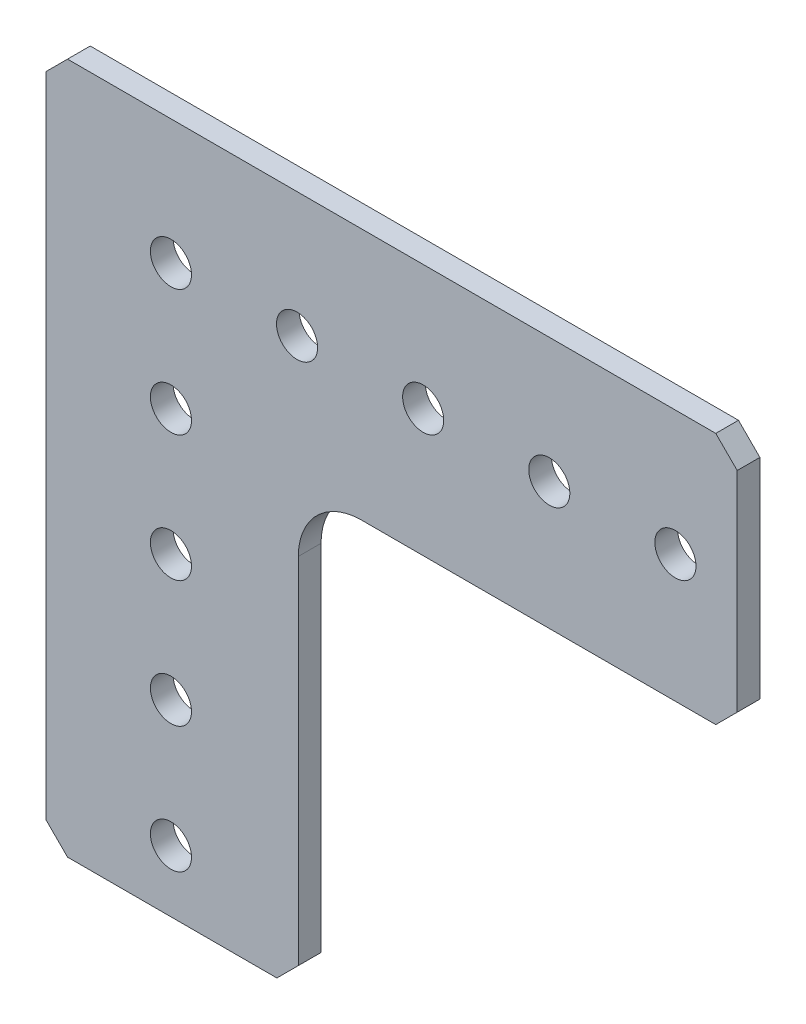
ISO-10303-21;
HEADER;
FILE_DESCRIPTION(('STEP AP214'),'2;1');
FILE_NAME('part.step','',(''),(''),'','','');
FILE_SCHEMA(('AUTOMOTIVE_DESIGN { 1 0 10303 214 1 1 1 1 }'));
ENDSEC;
DATA;
#1=APPLICATION_CONTEXT('core data for automotive mechanical design processes');
#2=APPLICATION_PROTOCOL_DEFINITION('international standard','automotive_design',2000,#1);
#3=PRODUCT_CONTEXT('',#1,'mechanical');
#4=PRODUCT('Part','Part','',(#3));
#5=PRODUCT_RELATED_PRODUCT_CATEGORY('part','',(#4));
#6=PRODUCT_DEFINITION_FORMATION('','',#4);
#7=PRODUCT_DEFINITION_CONTEXT('part definition',#1,'design');
#8=PRODUCT_DEFINITION('design','',#6,#7);
#9=PRODUCT_DEFINITION_SHAPE('','',#8);
#10=(LENGTH_UNIT() NAMED_UNIT(*) SI_UNIT(.MILLI.,.METRE.));
#11=(NAMED_UNIT(*) PLANE_ANGLE_UNIT() SI_UNIT($,.RADIAN.));
#12=(NAMED_UNIT(*) SI_UNIT($,.STERADIAN.) SOLID_ANGLE_UNIT());
#13=UNCERTAINTY_MEASURE_WITH_UNIT(LENGTH_MEASURE(1.E-05),#10,'distance_accuracy_value','');
#14=(GEOMETRIC_REPRESENTATION_CONTEXT(3) GLOBAL_UNCERTAINTY_ASSIGNED_CONTEXT((#13)) GLOBAL_UNIT_ASSIGNED_CONTEXT((#10,
#11,#12)) REPRESENTATION_CONTEXT('',''));
#15=CARTESIAN_POINT('',(0.,0.,0.));
#16=DIRECTION('',(0.,0.,1.));
#17=DIRECTION('',(1.,0.,0.));
#18=AXIS2_PLACEMENT_3D('',#15,#16,#17);
#19=CARTESIAN_POINT('',(-12.573,10.414,2.286));
#20=DIRECTION('',(-0.707106781186548,0.707106781186547,0.));
#21=DIRECTION('',(-0.707106781186547,-0.707106781186548,0.));
#22=AXIS2_PLACEMENT_3D('',#19,#20,#21);
#23=PLANE('',#22);
#24=DIRECTION('',(0.707106781186547,0.707106781186548,0.));
#25=VECTOR('',#24,1.);
#26=CARTESIAN_POINT('',(-12.573,10.414,0.));
#27=LINE('',#26,#25);
#28=CARTESIAN_POINT('',(-12.573,10.414,0.));
#29=VERTEX_POINT('',#28);
#30=CARTESIAN_POINT('',(-10.414,12.573,0.));
#31=VERTEX_POINT('',#30);
#32=EDGE_CURVE('E156',#29,#31,#27,.T.);
#33=ORIENTED_EDGE('',*,*,#32,.F.);
#34=DIRECTION('',(0.,0.,-1.));
#35=VECTOR('',#34,1.);
#36=CARTESIAN_POINT('',(-12.573,10.414,2.286));
#37=LINE('',#36,#35);
#38=CARTESIAN_POINT('',(-12.573,10.414,2.286));
#39=VERTEX_POINT('',#38);
#40=EDGE_CURVE('E11',#39,#29,#37,.T.);
#41=ORIENTED_EDGE('',*,*,#40,.F.);
#42=DIRECTION('',(0.707106781186547,0.707106781186548,0.));
#43=VECTOR('',#42,1.);
#44=CARTESIAN_POINT('',(-12.573,10.414,2.286));
#45=LINE('',#44,#43);
#46=CARTESIAN_POINT('',(-10.414,12.573,2.286));
#47=VERTEX_POINT('',#46);
#48=EDGE_CURVE('E189',#39,#47,#45,.T.);
#49=ORIENTED_EDGE('',*,*,#48,.T.);
#50=DIRECTION('',(0.,0.,-1.));
#51=VECTOR('',#50,1.);
#52=CARTESIAN_POINT('',(-10.414,12.573,2.286));
#53=LINE('',#52,#51);
#54=EDGE_CURVE('E38',#47,#31,#53,.T.);
#55=ORIENTED_EDGE('',*,*,#54,.T.);
#56=EDGE_LOOP('',(#33,#41,#49,#55));
#57=FACE_BOUND('',#56,.T.);
#58=ADVANCED_FACE('F35',(#57),#23,.T.);
#59=CARTESIAN_POINT('',(-12.573,-54.864,2.286));
#60=DIRECTION('',(-1.,0.,0.));
#61=DIRECTION('',(0.,-1.,0.));
#62=AXIS2_PLACEMENT_3D('',#59,#60,#61);
#63=PLANE('',#62);
#64=DIRECTION('',(0.,1.,0.));
#65=VECTOR('',#64,1.);
#66=CARTESIAN_POINT('',(-12.573,-54.864,0.));
#67=LINE('',#66,#65);
#68=CARTESIAN_POINT('',(-12.573,-54.864,0.));
#69=VERTEX_POINT('',#68);
#70=EDGE_CURVE('E187',#69,#29,#67,.T.);
#71=ORIENTED_EDGE('',*,*,#70,.F.);
#72=DIRECTION('',(0.,0.,-1.));
#73=VECTOR('',#72,1.);
#74=CARTESIAN_POINT('',(-12.573,-54.864,2.286));
#75=LINE('',#74,#73);
#76=CARTESIAN_POINT('',(-12.573,-54.864,2.286));
#77=VERTEX_POINT('',#76);
#78=EDGE_CURVE('E44',#77,#69,#75,.T.);
#79=ORIENTED_EDGE('',*,*,#78,.F.);
#80=DIRECTION('',(0.,1.,0.));
#81=VECTOR('',#80,1.);
#82=CARTESIAN_POINT('',(-12.573,-54.864,2.286));
#83=LINE('',#82,#81);
#84=EDGE_CURVE('E146',#77,#39,#83,.T.);
#85=ORIENTED_EDGE('',*,*,#84,.T.);
#86=ORIENTED_EDGE('',*,*,#40,.T.);
#87=EDGE_LOOP('',(#71,#79,#85,#86));
#88=FACE_BOUND('',#87,.T.);
#89=ADVANCED_FACE('F209',(#88),#63,.T.);
#90=CARTESIAN_POINT('',(-10.414,-57.023,2.286));
#91=DIRECTION('',(-0.707106781186544,-0.707106781186551,0.));
#92=DIRECTION('',(0.707106781186551,-0.707106781186544,0.));
#93=AXIS2_PLACEMENT_3D('',#90,#91,#92);
#94=PLANE('',#93);
#95=DIRECTION('',(-0.707106781186551,0.707106781186544,0.));
#96=VECTOR('',#95,1.);
#97=CARTESIAN_POINT('',(-10.414,-57.023,0.));
#98=LINE('',#97,#96);
#99=CARTESIAN_POINT('',(-10.414,-57.023,0.));
#100=VERTEX_POINT('',#99);
#101=EDGE_CURVE('E133',#100,#69,#98,.T.);
#102=ORIENTED_EDGE('',*,*,#101,.F.);
#103=DIRECTION('',(0.,0.,-1.));
#104=VECTOR('',#103,1.);
#105=CARTESIAN_POINT('',(-10.414,-57.023,2.286));
#106=LINE('',#105,#104);
#107=CARTESIAN_POINT('',(-10.414,-57.023,2.286));
#108=VERTEX_POINT('',#107);
#109=EDGE_CURVE('E128',#108,#100,#106,.T.);
#110=ORIENTED_EDGE('',*,*,#109,.F.);
#111=DIRECTION('',(-0.707106781186551,0.707106781186544,0.));
#112=VECTOR('',#111,1.);
#113=CARTESIAN_POINT('',(-10.414,-57.023,2.286));
#114=LINE('',#113,#112);
#115=EDGE_CURVE('E131',#108,#77,#114,.T.);
#116=ORIENTED_EDGE('',*,*,#115,.T.);
#117=ORIENTED_EDGE('',*,*,#78,.T.);
#118=EDGE_LOOP('',(#102,#110,#116,#117));
#119=FACE_BOUND('',#118,.T.);
#120=ADVANCED_FACE('F130',(#119),#94,.T.);
#121=CARTESIAN_POINT('',(10.668,-57.023,2.286));
#122=DIRECTION('',(0.,-1.,0.));
#123=DIRECTION('',(1.,0.,0.));
#124=AXIS2_PLACEMENT_3D('',#121,#122,#123);
#125=PLANE('',#124);
#126=DIRECTION('',(-1.,0.,0.));
#127=VECTOR('',#126,1.);
#128=CARTESIAN_POINT('',(10.668,-57.023,0.));
#129=LINE('',#128,#127);
#130=CARTESIAN_POINT('',(10.668,-57.023,0.));
#131=VERTEX_POINT('',#130);
#132=EDGE_CURVE('E184',#131,#100,#129,.T.);
#133=ORIENTED_EDGE('',*,*,#132,.F.);
#134=DIRECTION('',(0.,0.,-1.));
#135=VECTOR('',#134,1.);
#136=CARTESIAN_POINT('',(10.668,-57.023,2.286));
#137=LINE('',#136,#135);
#138=CARTESIAN_POINT('',(10.668,-57.023,2.286));
#139=VERTEX_POINT('',#138);
#140=EDGE_CURVE('E138',#139,#131,#137,.T.);
#141=ORIENTED_EDGE('',*,*,#140,.F.);
#142=DIRECTION('',(-1.,0.,0.));
#143=VECTOR('',#142,1.);
#144=CARTESIAN_POINT('',(10.668,-57.023,2.286));
#145=LINE('',#144,#143);
#146=EDGE_CURVE('E144',#139,#108,#145,.T.);
#147=ORIENTED_EDGE('',*,*,#146,.T.);
#148=ORIENTED_EDGE('',*,*,#109,.T.);
#149=EDGE_LOOP('',(#133,#141,#147,#148));
#150=FACE_BOUND('',#149,.T.);
#151=ADVANCED_FACE('F148',(#150),#125,.T.);
#152=CARTESIAN_POINT('',(12.827,-54.864,2.286));
#153=DIRECTION('',(0.707106781186548,-0.707106781186547,0.));
#154=DIRECTION('',(0.707106781186547,0.707106781186548,0.));
#155=AXIS2_PLACEMENT_3D('',#152,#153,#154);
#156=PLANE('',#155);
#157=DIRECTION('',(-0.707106781186547,-0.707106781186548,0.));
#158=VECTOR('',#157,1.);
#159=CARTESIAN_POINT('',(12.827,-54.864,0.));
#160=LINE('',#159,#158);
#161=CARTESIAN_POINT('',(12.827,-54.864,0.));
#162=VERTEX_POINT('',#161);
#163=EDGE_CURVE('E181',#162,#131,#160,.T.);
#164=ORIENTED_EDGE('',*,*,#163,.F.);
#165=DIRECTION('',(0.,0.,-1.));
#166=VECTOR('',#165,1.);
#167=CARTESIAN_POINT('',(12.827,-54.864,2.286));
#168=LINE('',#167,#166);
#169=CARTESIAN_POINT('',(12.827,-54.864,2.286));
#170=VERTEX_POINT('',#169);
#171=EDGE_CURVE('E193',#170,#162,#168,.T.);
#172=ORIENTED_EDGE('',*,*,#171,.F.);
#173=DIRECTION('',(-0.707106781186547,-0.707106781186548,0.));
#174=VECTOR('',#173,1.);
#175=CARTESIAN_POINT('',(12.827,-54.864,2.286));
#176=LINE('',#175,#174);
#177=EDGE_CURVE('E149',#170,#139,#176,.T.);
#178=ORIENTED_EDGE('',*,*,#177,.T.);
#179=ORIENTED_EDGE('',*,*,#140,.T.);
#180=EDGE_LOOP('',(#164,#172,#178,#179));
#181=FACE_BOUND('',#180,.T.);
#182=ADVANCED_FACE('F222',(#181),#156,.T.);
#183=CARTESIAN_POINT('',(12.827,-19.177,2.286));
#184=DIRECTION('',(1.,0.,0.));
#185=DIRECTION('',(0.,0.,-1.));
#186=AXIS2_PLACEMENT_3D('',#183,#184,#185);
#187=PLANE('',#186);
#188=DIRECTION('',(0.,-1.,0.));
#189=VECTOR('',#188,1.);
#190=CARTESIAN_POINT('',(12.827,-19.177,0.));
#191=LINE('',#190,#189);
#192=CARTESIAN_POINT('',(12.827,-19.177,0.));
#193=VERTEX_POINT('',#192);
#194=EDGE_CURVE('E178',#193,#162,#191,.T.);
#195=ORIENTED_EDGE('',*,*,#194,.F.);
#196=DIRECTION('',(0.,0.,-1.));
#197=VECTOR('',#196,1.);
#198=CARTESIAN_POINT('',(12.827,-19.177,2.286));
#199=LINE('',#198,#197);
#200=CARTESIAN_POINT('',(12.827,-19.177,2.286));
#201=VERTEX_POINT('',#200);
#202=EDGE_CURVE('E195',#201,#193,#199,.T.);
#203=ORIENTED_EDGE('',*,*,#202,.F.);
#204=DIRECTION('',(0.,-1.,0.));
#205=VECTOR('',#204,1.);
#206=CARTESIAN_POINT('',(12.827,-19.177,2.286));
#207=LINE('',#206,#205);
#208=EDGE_CURVE('E151',#201,#170,#207,.T.);
#209=ORIENTED_EDGE('',*,*,#208,.T.);
#210=ORIENTED_EDGE('',*,*,#171,.T.);
#211=EDGE_LOOP('',(#195,#203,#209,#210));
#212=FACE_BOUND('',#211,.T.);
#213=ADVANCED_FACE('F225',(#212),#187,.T.);
#214=CARTESIAN_POINT('',(19.177,-19.177,2.286));
#215=DIRECTION('',(0.,0.,-1.));
#216=DIRECTION('',(-1.,0.,0.));
#217=AXIS2_PLACEMENT_3D('',#214,#215,#216);
#218=CYLINDRICAL_SURFACE('',#217,6.35);
#219=CARTESIAN_POINT('',(19.177,-19.177,0.));
#220=DIRECTION('',(0.,0.,1.));
#221=DIRECTION('',(1.,0.,0.));
#222=AXIS2_PLACEMENT_3D('',#219,#220,#221);
#223=CIRCLE('',#222,6.35);
#224=CARTESIAN_POINT('',(19.177,-12.827,0.));
#225=VERTEX_POINT('',#224);
#226=EDGE_CURVE('E175',#225,#193,#223,.T.);
#227=ORIENTED_EDGE('',*,*,#226,.F.);
#228=DIRECTION('',(0.,0.,-1.));
#229=VECTOR('',#228,1.);
#230=CARTESIAN_POINT('',(19.177,-12.827,2.286));
#231=LINE('',#230,#229);
#232=CARTESIAN_POINT('',(19.177,-12.827,2.286));
#233=VERTEX_POINT('',#232);
#234=EDGE_CURVE('E197',#233,#225,#231,.T.);
#235=ORIENTED_EDGE('',*,*,#234,.F.);
#236=CARTESIAN_POINT('',(19.177,-19.177,2.286));
#237=DIRECTION('',(0.,0.,1.));
#238=DIRECTION('',(1.,0.,0.));
#239=AXIS2_PLACEMENT_3D('',#236,#237,#238);
#240=CIRCLE('',#239,6.35);
#241=EDGE_CURVE('E369',#233,#201,#240,.T.);
#242=ORIENTED_EDGE('',*,*,#241,.T.);
#243=ORIENTED_EDGE('',*,*,#202,.T.);
#244=EDGE_LOOP('',(#227,#235,#242,#243));
#245=FACE_BOUND('',#244,.T.);
#246=ADVANCED_FACE('F229',(#245),#218,.F.);
#247=CARTESIAN_POINT('',(54.864,-12.827,2.286));
#248=DIRECTION('',(0.,-1.,0.));
#249=DIRECTION('',(0.,0.,-1.));
#250=AXIS2_PLACEMENT_3D('',#247,#248,#249);
#251=PLANE('',#250);
#252=DIRECTION('',(-1.,0.,0.));
#253=VECTOR('',#252,1.);
#254=CARTESIAN_POINT('',(54.864,-12.827,0.));
#255=LINE('',#254,#253);
#256=CARTESIAN_POINT('',(54.864,-12.827,0.));
#257=VERTEX_POINT('',#256);
#258=EDGE_CURVE('E172',#257,#225,#255,.T.);
#259=ORIENTED_EDGE('',*,*,#258,.F.);
#260=DIRECTION('',(0.,0.,-1.));
#261=VECTOR('',#260,1.);
#262=CARTESIAN_POINT('',(54.864,-12.827,2.286));
#263=LINE('',#262,#261);
#264=CARTESIAN_POINT('',(54.864,-12.827,2.286));
#265=VERTEX_POINT('',#264);
#266=EDGE_CURVE('E199',#265,#257,#263,.T.);
#267=ORIENTED_EDGE('',*,*,#266,.F.);
#268=DIRECTION('',(-1.,0.,0.));
#269=VECTOR('',#268,1.);
#270=CARTESIAN_POINT('',(54.864,-12.827,2.286));
#271=LINE('',#270,#269);
#272=EDGE_CURVE('E366',#265,#233,#271,.T.);
#273=ORIENTED_EDGE('',*,*,#272,.T.);
#274=ORIENTED_EDGE('',*,*,#234,.T.);
#275=EDGE_LOOP('',(#259,#267,#273,#274));
#276=FACE_BOUND('',#275,.T.);
#277=ADVANCED_FACE('F233',(#276),#251,.T.);
#278=CARTESIAN_POINT('',(57.023,-10.668,2.286));
#279=DIRECTION('',(0.707106781186548,-0.707106781186546,0.));
#280=DIRECTION('',(0.707106781186547,0.707106781186548,0.));
#281=AXIS2_PLACEMENT_3D('',#278,#279,#280);
#282=PLANE('',#281);
#283=DIRECTION('',(-0.707106781186547,-0.707106781186548,0.));
#284=VECTOR('',#283,1.);
#285=CARTESIAN_POINT('',(57.023,-10.668,0.));
#286=LINE('',#285,#284);
#287=CARTESIAN_POINT('',(57.023,-10.668,0.));
#288=VERTEX_POINT('',#287);
#289=EDGE_CURVE('E169',#288,#257,#286,.T.);
#290=ORIENTED_EDGE('',*,*,#289,.F.);
#291=DIRECTION('',(0.,0.,-1.));
#292=VECTOR('',#291,1.);
#293=CARTESIAN_POINT('',(57.023,-10.668,2.286));
#294=LINE('',#293,#292);
#295=CARTESIAN_POINT('',(57.023,-10.668,2.286));
#296=VERTEX_POINT('',#295);
#297=EDGE_CURVE('E201',#296,#288,#294,.T.);
#298=ORIENTED_EDGE('',*,*,#297,.F.);
#299=DIRECTION('',(-0.707106781186547,-0.707106781186548,0.));
#300=VECTOR('',#299,1.);
#301=CARTESIAN_POINT('',(57.023,-10.668,2.286));
#302=LINE('',#301,#300);
#303=EDGE_CURVE('E363',#296,#265,#302,.T.);
#304=ORIENTED_EDGE('',*,*,#303,.T.);
#305=ORIENTED_EDGE('',*,*,#266,.T.);
#306=EDGE_LOOP('',(#290,#298,#304,#305));
#307=FACE_BOUND('',#306,.T.);
#308=ADVANCED_FACE('F237',(#307),#282,.T.);
#309=CARTESIAN_POINT('',(57.023,10.414,2.286));
#310=DIRECTION('',(1.,0.,0.));
#311=DIRECTION('',(0.,1.,0.));
#312=AXIS2_PLACEMENT_3D('',#309,#310,#311);
#313=PLANE('',#312);
#314=DIRECTION('',(0.,-1.,0.));
#315=VECTOR('',#314,1.);
#316=CARTESIAN_POINT('',(57.023,10.414,0.));
#317=LINE('',#316,#315);
#318=CARTESIAN_POINT('',(57.023,10.414,0.));
#319=VERTEX_POINT('',#318);
#320=EDGE_CURVE('E166',#319,#288,#317,.T.);
#321=ORIENTED_EDGE('',*,*,#320,.F.);
#322=DIRECTION('',(0.,0.,-1.));
#323=VECTOR('',#322,1.);
#324=CARTESIAN_POINT('',(57.023,10.414,2.286));
#325=LINE('',#324,#323);
#326=CARTESIAN_POINT('',(57.023,10.414,2.286));
#327=VERTEX_POINT('',#326);
#328=EDGE_CURVE('E203',#327,#319,#325,.T.);
#329=ORIENTED_EDGE('',*,*,#328,.F.);
#330=DIRECTION('',(0.,-1.,0.));
#331=VECTOR('',#330,1.);
#332=CARTESIAN_POINT('',(57.023,10.414,2.286));
#333=LINE('',#332,#331);
#334=EDGE_CURVE('E360',#327,#296,#333,.T.);
#335=ORIENTED_EDGE('',*,*,#334,.T.);
#336=ORIENTED_EDGE('',*,*,#297,.T.);
#337=EDGE_LOOP('',(#321,#329,#335,#336));
#338=FACE_BOUND('',#337,.T.);
#339=ADVANCED_FACE('F241',(#338),#313,.T.);
#340=CARTESIAN_POINT('',(54.864,12.573,2.286));
#341=DIRECTION('',(0.707106781186544,0.70710678118655,0.));
#342=DIRECTION('',(-0.707106781186551,0.707106781186544,0.));
#343=AXIS2_PLACEMENT_3D('',#340,#341,#342);
#344=PLANE('',#343);
#345=DIRECTION('',(0.707106781186551,-0.707106781186544,0.));
#346=VECTOR('',#345,1.);
#347=CARTESIAN_POINT('',(54.864,12.573,0.));
#348=LINE('',#347,#346);
#349=CARTESIAN_POINT('',(54.864,12.573,0.));
#350=VERTEX_POINT('',#349);
#351=EDGE_CURVE('E163',#350,#319,#348,.T.);
#352=ORIENTED_EDGE('',*,*,#351,.F.);
#353=DIRECTION('',(0.,0.,-1.));
#354=VECTOR('',#353,1.);
#355=CARTESIAN_POINT('',(54.864,12.573,2.286));
#356=LINE('',#355,#354);
#357=CARTESIAN_POINT('',(54.864,12.573,2.286));
#358=VERTEX_POINT('',#357);
#359=EDGE_CURVE('E204',#358,#350,#356,.T.);
#360=ORIENTED_EDGE('',*,*,#359,.F.);
#361=DIRECTION('',(0.707106781186551,-0.707106781186544,0.));
#362=VECTOR('',#361,1.);
#363=CARTESIAN_POINT('',(54.864,12.573,2.286));
#364=LINE('',#363,#362);
#365=EDGE_CURVE('E357',#358,#327,#364,.T.);
#366=ORIENTED_EDGE('',*,*,#365,.T.);
#367=ORIENTED_EDGE('',*,*,#328,.T.);
#368=EDGE_LOOP('',(#352,#360,#366,#367));
#369=FACE_BOUND('',#368,.T.);
#370=ADVANCED_FACE('F245',(#369),#344,.T.);
#371=CARTESIAN_POINT('',(-10.414,12.573,2.286));
#372=DIRECTION('',(0.,1.,0.));
#373=DIRECTION('',(-1.,0.,0.));
#374=AXIS2_PLACEMENT_3D('',#371,#372,#373);
#375=PLANE('',#374);
#376=DIRECTION('',(1.,0.,0.));
#377=VECTOR('',#376,1.);
#378=CARTESIAN_POINT('',(-10.414,12.573,0.));
#379=LINE('',#378,#377);
#380=EDGE_CURVE('E159',#31,#350,#379,.T.);
#381=ORIENTED_EDGE('',*,*,#380,.F.);
#382=ORIENTED_EDGE('',*,*,#54,.F.);
#383=DIRECTION('',(1.,0.,0.));
#384=VECTOR('',#383,1.);
#385=CARTESIAN_POINT('',(-10.414,12.573,2.286));
#386=LINE('',#385,#384);
#387=EDGE_CURVE('E355',#47,#358,#386,.T.);
#388=ORIENTED_EDGE('',*,*,#387,.T.);
#389=ORIENTED_EDGE('',*,*,#359,.T.);
#390=EDGE_LOOP('',(#381,#382,#388,#389));
#391=FACE_BOUND('',#390,.T.);
#392=ADVANCED_FACE('F206',(#391),#375,.T.);
#393=CARTESIAN_POINT('',(19.177,-19.177,2.286));
#394=DIRECTION('',(0.,0.,1.));
#395=DIRECTION('',(1.,0.,0.));
#396=AXIS2_PLACEMENT_3D('',#393,#394,#395);
#397=PLANE('',#396);
#398=CARTESIAN_POINT('',(50.8,0.,2.286));
#399=DIRECTION('',(0.,0.,-1.));
#400=DIRECTION('',(1.,0.,0.));
#401=AXIS2_PLACEMENT_3D('',#398,#399,#400);
#402=CIRCLE('',#401,2.0701);
#403=CARTESIAN_POINT('',(52.8701,0.,2.286));
#404=VERTEX_POINT('',#403);
#405=EDGE_CURVE('E300',#404,#404,#402,.T.);
#406=ORIENTED_EDGE('',*,*,#405,.T.);
#407=EDGE_LOOP('',(#406));
#408=FACE_BOUND('',#407,.T.);
#409=CARTESIAN_POINT('',(3.9907631702977E-13,-38.1,2.286));
#410=DIRECTION('',(0.,0.,-1.));
#411=DIRECTION('',(1.,0.,0.));
#412=AXIS2_PLACEMENT_3D('',#409,#410,#411);
#413=CIRCLE('',#412,2.0701);
#414=CARTESIAN_POINT('',(2.0701000000004,-38.1,2.286));
#415=VERTEX_POINT('',#414);
#416=EDGE_CURVE('E308',#415,#415,#413,.T.);
#417=ORIENTED_EDGE('',*,*,#416,.T.);
#418=EDGE_LOOP('',(#417));
#419=FACE_BOUND('',#418,.T.);
#420=CARTESIAN_POINT('',(1.33025439009923E-13,-12.7,2.286));
#421=DIRECTION('',(0.,0.,-1.));
#422=DIRECTION('',(1.,0.,0.));
#423=AXIS2_PLACEMENT_3D('',#420,#421,#422);
#424=CIRCLE('',#423,2.0701);
#425=CARTESIAN_POINT('',(2.07010000000013,-12.7,2.286));
#426=VERTEX_POINT('',#425);
#427=EDGE_CURVE('E314',#426,#426,#424,.T.);
#428=ORIENTED_EDGE('',*,*,#427,.T.);
#429=EDGE_LOOP('',(#428));
#430=FACE_BOUND('',#429,.T.);
#431=CARTESIAN_POINT('',(25.4,3.54734504026462E-13,2.286));
#432=DIRECTION('',(0.,0.,-1.));
#433=DIRECTION('',(1.,0.,0.));
#434=AXIS2_PLACEMENT_3D('',#431,#432,#433);
#435=CIRCLE('',#434,2.0701);
#436=CARTESIAN_POINT('',(27.4701,3.54734504026462E-13,2.286));
#437=VERTEX_POINT('',#436);
#438=EDGE_CURVE('E320',#437,#437,#435,.T.);
#439=ORIENTED_EDGE('',*,*,#438,.T.);
#440=EDGE_LOOP('',(#439));
#441=FACE_BOUND('',#440,.T.);
#442=CARTESIAN_POINT('',(0.,0.,2.286));
#443=DIRECTION('',(0.,0.,-1.));
#444=DIRECTION('',(1.,0.,0.));
#445=AXIS2_PLACEMENT_3D('',#442,#443,#444);
#446=CIRCLE('',#445,2.0701);
#447=CARTESIAN_POINT('',(2.0701,0.,2.286));
#448=VERTEX_POINT('',#447);
#449=EDGE_CURVE('E326',#448,#448,#446,.T.);
#450=ORIENTED_EDGE('',*,*,#449,.T.);
#451=EDGE_LOOP('',(#450));
#452=FACE_BOUND('',#451,.T.);
#453=CARTESIAN_POINT('',(12.7,1.77367252013231E-13,2.286));
#454=DIRECTION('',(0.,0.,-1.));
#455=DIRECTION('',(1.,0.,0.));
#456=AXIS2_PLACEMENT_3D('',#453,#454,#455);
#457=CIRCLE('',#456,2.0701);
#458=CARTESIAN_POINT('',(14.7701,1.77367252013231E-13,2.286));
#459=VERTEX_POINT('',#458);
#460=EDGE_CURVE('E332',#459,#459,#457,.T.);
#461=ORIENTED_EDGE('',*,*,#460,.T.);
#462=EDGE_LOOP('',(#461));
#463=FACE_BOUND('',#462,.T.);
#464=CARTESIAN_POINT('',(38.1,0.,2.286));
#465=DIRECTION('',(0.,0.,-1.));
#466=DIRECTION('',(1.,0.,0.));
#467=AXIS2_PLACEMENT_3D('',#464,#465,#466);
#468=CIRCLE('',#467,2.0701);
#469=CARTESIAN_POINT('',(40.1701,0.,2.286));
#470=VERTEX_POINT('',#469);
#471=EDGE_CURVE('E338',#470,#470,#468,.T.);
#472=ORIENTED_EDGE('',*,*,#471,.T.);
#473=EDGE_LOOP('',(#472));
#474=FACE_BOUND('',#473,.T.);
#475=CARTESIAN_POINT('',(2.66050878019847E-13,-25.4,2.286));
#476=DIRECTION('',(0.,0.,-1.));
#477=DIRECTION('',(1.,0.,0.));
#478=AXIS2_PLACEMENT_3D('',#475,#476,#477);
#479=CIRCLE('',#478,2.0701);
#480=CARTESIAN_POINT('',(2.07010000000027,-25.4,2.286));
#481=VERTEX_POINT('',#480);
#482=EDGE_CURVE('E344',#481,#481,#479,.T.);
#483=ORIENTED_EDGE('',*,*,#482,.T.);
#484=EDGE_LOOP('',(#483));
#485=FACE_BOUND('',#484,.T.);
#486=CARTESIAN_POINT('',(0.,-50.8,2.286));
#487=DIRECTION('',(0.,0.,-1.));
#488=DIRECTION('',(1.,0.,0.));
#489=AXIS2_PLACEMENT_3D('',#486,#487,#488);
#490=CIRCLE('',#489,2.0701);
#491=CARTESIAN_POINT('',(2.07010000000001,-50.8,2.286));
#492=VERTEX_POINT('',#491);
#493=EDGE_CURVE('E160',#492,#492,#490,.T.);
#494=ORIENTED_EDGE('',*,*,#493,.T.);
#495=EDGE_LOOP('',(#494));
#496=FACE_BOUND('',#495,.T.);
#497=ORIENTED_EDGE('',*,*,#48,.F.);
#498=ORIENTED_EDGE('',*,*,#84,.F.);
#499=ORIENTED_EDGE('',*,*,#115,.F.);
#500=ORIENTED_EDGE('',*,*,#146,.F.);
#501=ORIENTED_EDGE('',*,*,#177,.F.);
#502=ORIENTED_EDGE('',*,*,#208,.F.);
#503=ORIENTED_EDGE('',*,*,#241,.F.);
#504=ORIENTED_EDGE('',*,*,#272,.F.);
#505=ORIENTED_EDGE('',*,*,#303,.F.);
#506=ORIENTED_EDGE('',*,*,#334,.F.);
#507=ORIENTED_EDGE('',*,*,#365,.F.);
#508=ORIENTED_EDGE('',*,*,#387,.F.);
#509=EDGE_LOOP('',(#497,#498,#499,#500,#501,#502,#503,#504,#505,#506,#507,#508));
#510=FACE_BOUND('',#509,.T.);
#511=ADVANCED_FACE('F142',(#408,#419,#430,#441,#452,#463,#474,#485,#496,#510),#397,.T.);
#512=CARTESIAN_POINT('',(19.177,-19.177,0.));
#513=DIRECTION('',(0.,0.,1.));
#514=DIRECTION('',(1.,0.,0.));
#515=AXIS2_PLACEMENT_3D('',#512,#513,#514);
#516=PLANE('',#515);
#517=CARTESIAN_POINT('',(50.8,0.,0.));
#518=DIRECTION('',(0.,0.,-1.));
#519=DIRECTION('',(1.,0.,0.));
#520=AXIS2_PLACEMENT_3D('',#517,#518,#519);
#521=CIRCLE('',#520,2.0701);
#522=CARTESIAN_POINT('',(52.8701,0.,0.));
#523=VERTEX_POINT('',#522);
#524=EDGE_CURVE('E303',#523,#523,#521,.T.);
#525=ORIENTED_EDGE('',*,*,#524,.F.);
#526=EDGE_LOOP('',(#525));
#527=FACE_BOUND('',#526,.T.);
#528=CARTESIAN_POINT('',(3.9907631702977E-13,-38.1,0.));
#529=DIRECTION('',(0.,0.,-1.));
#530=DIRECTION('',(1.,0.,0.));
#531=AXIS2_PLACEMENT_3D('',#528,#529,#530);
#532=CIRCLE('',#531,2.0701);
#533=CARTESIAN_POINT('',(2.0701000000004,-38.1,0.));
#534=VERTEX_POINT('',#533);
#535=EDGE_CURVE('E305',#534,#534,#532,.T.);
#536=ORIENTED_EDGE('',*,*,#535,.F.);
#537=EDGE_LOOP('',(#536));
#538=FACE_BOUND('',#537,.T.);
#539=CARTESIAN_POINT('',(1.33025439009923E-13,-12.7,0.));
#540=DIRECTION('',(0.,0.,-1.));
#541=DIRECTION('',(1.,0.,0.));
#542=AXIS2_PLACEMENT_3D('',#539,#540,#541);
#543=CIRCLE('',#542,2.0701);
#544=CARTESIAN_POINT('',(2.07010000000013,-12.7,0.));
#545=VERTEX_POINT('',#544);
#546=EDGE_CURVE('E311',#545,#545,#543,.T.);
#547=ORIENTED_EDGE('',*,*,#546,.F.);
#548=EDGE_LOOP('',(#547));
#549=FACE_BOUND('',#548,.T.);
#550=CARTESIAN_POINT('',(25.4,3.54734504026462E-13,0.));
#551=DIRECTION('',(0.,0.,-1.));
#552=DIRECTION('',(1.,0.,0.));
#553=AXIS2_PLACEMENT_3D('',#550,#551,#552);
#554=CIRCLE('',#553,2.0701);
#555=CARTESIAN_POINT('',(27.4701,3.54734504026462E-13,0.));
#556=VERTEX_POINT('',#555);
#557=EDGE_CURVE('E317',#556,#556,#554,.T.);
#558=ORIENTED_EDGE('',*,*,#557,.F.);
#559=EDGE_LOOP('',(#558));
#560=FACE_BOUND('',#559,.T.);
#561=CARTESIAN_POINT('',(0.,0.,0.));
#562=DIRECTION('',(0.,0.,-1.));
#563=DIRECTION('',(1.,0.,0.));
#564=AXIS2_PLACEMENT_3D('',#561,#562,#563);
#565=CIRCLE('',#564,2.0701);
#566=CARTESIAN_POINT('',(2.0701,0.,0.));
#567=VERTEX_POINT('',#566);
#568=EDGE_CURVE('E323',#567,#567,#565,.T.);
#569=ORIENTED_EDGE('',*,*,#568,.F.);
#570=EDGE_LOOP('',(#569));
#571=FACE_BOUND('',#570,.T.);
#572=CARTESIAN_POINT('',(12.7,1.77367252013231E-13,0.));
#573=DIRECTION('',(0.,0.,-1.));
#574=DIRECTION('',(1.,0.,0.));
#575=AXIS2_PLACEMENT_3D('',#572,#573,#574);
#576=CIRCLE('',#575,2.0701);
#577=CARTESIAN_POINT('',(14.7701,1.77367252013231E-13,0.));
#578=VERTEX_POINT('',#577);
#579=EDGE_CURVE('E329',#578,#578,#576,.T.);
#580=ORIENTED_EDGE('',*,*,#579,.F.);
#581=EDGE_LOOP('',(#580));
#582=FACE_BOUND('',#581,.T.);
#583=CARTESIAN_POINT('',(38.1,0.,0.));
#584=DIRECTION('',(0.,0.,-1.));
#585=DIRECTION('',(1.,0.,0.));
#586=AXIS2_PLACEMENT_3D('',#583,#584,#585);
#587=CIRCLE('',#586,2.0701);
#588=CARTESIAN_POINT('',(40.1701,0.,0.));
#589=VERTEX_POINT('',#588);
#590=EDGE_CURVE('E335',#589,#589,#587,.T.);
#591=ORIENTED_EDGE('',*,*,#590,.F.);
#592=EDGE_LOOP('',(#591));
#593=FACE_BOUND('',#592,.T.);
#594=CARTESIAN_POINT('',(2.66050878019847E-13,-25.4,0.));
#595=DIRECTION('',(0.,0.,-1.));
#596=DIRECTION('',(1.,0.,0.));
#597=AXIS2_PLACEMENT_3D('',#594,#595,#596);
#598=CIRCLE('',#597,2.0701);
#599=CARTESIAN_POINT('',(2.07010000000027,-25.4,0.));
#600=VERTEX_POINT('',#599);
#601=EDGE_CURVE('E341',#600,#600,#598,.T.);
#602=ORIENTED_EDGE('',*,*,#601,.F.);
#603=EDGE_LOOP('',(#602));
#604=FACE_BOUND('',#603,.T.);
#605=CARTESIAN_POINT('',(0.,-50.8,0.));
#606=DIRECTION('',(0.,0.,-1.));
#607=DIRECTION('',(1.,0.,0.));
#608=AXIS2_PLACEMENT_3D('',#605,#606,#607);
#609=CIRCLE('',#608,2.0701);
#610=CARTESIAN_POINT('',(2.07010000000001,-50.8,0.));
#611=VERTEX_POINT('',#610);
#612=EDGE_CURVE('E347',#611,#611,#609,.T.);
#613=ORIENTED_EDGE('',*,*,#612,.F.);
#614=EDGE_LOOP('',(#613));
#615=FACE_BOUND('',#614,.T.);
#616=ORIENTED_EDGE('',*,*,#32,.T.);
#617=ORIENTED_EDGE('',*,*,#380,.T.);
#618=ORIENTED_EDGE('',*,*,#351,.T.);
#619=ORIENTED_EDGE('',*,*,#320,.T.);
#620=ORIENTED_EDGE('',*,*,#289,.T.);
#621=ORIENTED_EDGE('',*,*,#258,.T.);
#622=ORIENTED_EDGE('',*,*,#226,.T.);
#623=ORIENTED_EDGE('',*,*,#194,.T.);
#624=ORIENTED_EDGE('',*,*,#163,.T.);
#625=ORIENTED_EDGE('',*,*,#132,.T.);
#626=ORIENTED_EDGE('',*,*,#101,.T.);
#627=ORIENTED_EDGE('',*,*,#70,.T.);
#628=EDGE_LOOP('',(#616,#617,#618,#619,#620,#621,#622,#623,#624,#625,#626,#627));
#629=FACE_BOUND('',#628,.T.);
#630=ADVANCED_FACE('F208',(#527,#538,#549,#560,#571,#582,#593,#604,#615,#629),#516,.F.);
#631=CARTESIAN_POINT('',(0.,-50.8,2.286));
#632=DIRECTION('',(0.,0.,-1.));
#633=DIRECTION('',(-1.,0.,0.));
#634=AXIS2_PLACEMENT_3D('',#631,#632,#633);
#635=CYLINDRICAL_SURFACE('',#634,2.0701);
#636=ORIENTED_EDGE('',*,*,#493,.F.);
#637=EDGE_LOOP('',(#636));
#638=FACE_BOUND('',#637,.T.);
#639=ORIENTED_EDGE('',*,*,#612,.T.);
#640=EDGE_LOOP('',(#639));
#641=FACE_BOUND('',#640,.T.);
#642=ADVANCED_FACE('F257',(#638,#641),#635,.F.);
#643=CARTESIAN_POINT('',(2.66050878019847E-13,-25.4,2.286));
#644=DIRECTION('',(0.,0.,-1.));
#645=DIRECTION('',(-1.,0.,0.));
#646=AXIS2_PLACEMENT_3D('',#643,#644,#645);
#647=CYLINDRICAL_SURFACE('',#646,2.0701);
#648=ORIENTED_EDGE('',*,*,#482,.F.);
#649=EDGE_LOOP('',(#648));
#650=FACE_BOUND('',#649,.T.);
#651=ORIENTED_EDGE('',*,*,#601,.T.);
#652=EDGE_LOOP('',(#651));
#653=FACE_BOUND('',#652,.T.);
#654=ADVANCED_FACE('F264',(#650,#653),#647,.F.);
#655=CARTESIAN_POINT('',(38.1,0.,2.286));
#656=DIRECTION('',(0.,0.,-1.));
#657=DIRECTION('',(-1.,0.,0.));
#658=AXIS2_PLACEMENT_3D('',#655,#656,#657);
#659=CYLINDRICAL_SURFACE('',#658,2.0701);
#660=ORIENTED_EDGE('',*,*,#471,.F.);
#661=EDGE_LOOP('',(#660));
#662=FACE_BOUND('',#661,.T.);
#663=ORIENTED_EDGE('',*,*,#590,.T.);
#664=EDGE_LOOP('',(#663));
#665=FACE_BOUND('',#664,.T.);
#666=ADVANCED_FACE('F268',(#662,#665),#659,.F.);
#667=CARTESIAN_POINT('',(12.7,1.77367252013231E-13,2.286));
#668=DIRECTION('',(0.,0.,-1.));
#669=DIRECTION('',(-1.,0.,0.));
#670=AXIS2_PLACEMENT_3D('',#667,#668,#669);
#671=CYLINDRICAL_SURFACE('',#670,2.0701);
#672=ORIENTED_EDGE('',*,*,#460,.F.);
#673=EDGE_LOOP('',(#672));
#674=FACE_BOUND('',#673,.T.);
#675=ORIENTED_EDGE('',*,*,#579,.T.);
#676=EDGE_LOOP('',(#675));
#677=FACE_BOUND('',#676,.T.);
#678=ADVANCED_FACE('F272',(#674,#677),#671,.F.);
#679=CARTESIAN_POINT('',(0.,0.,2.286));
#680=DIRECTION('',(0.,0.,-1.));
#681=DIRECTION('',(-1.,0.,0.));
#682=AXIS2_PLACEMENT_3D('',#679,#680,#681);
#683=CYLINDRICAL_SURFACE('',#682,2.0701);
#684=ORIENTED_EDGE('',*,*,#449,.F.);
#685=EDGE_LOOP('',(#684));
#686=FACE_BOUND('',#685,.T.);
#687=ORIENTED_EDGE('',*,*,#568,.T.);
#688=EDGE_LOOP('',(#687));
#689=FACE_BOUND('',#688,.T.);
#690=ADVANCED_FACE('F276',(#686,#689),#683,.F.);
#691=CARTESIAN_POINT('',(25.4,3.54734504026462E-13,2.286));
#692=DIRECTION('',(0.,0.,-1.));
#693=DIRECTION('',(-1.,0.,0.));
#694=AXIS2_PLACEMENT_3D('',#691,#692,#693);
#695=CYLINDRICAL_SURFACE('',#694,2.0701);
#696=ORIENTED_EDGE('',*,*,#438,.F.);
#697=EDGE_LOOP('',(#696));
#698=FACE_BOUND('',#697,.T.);
#699=ORIENTED_EDGE('',*,*,#557,.T.);
#700=EDGE_LOOP('',(#699));
#701=FACE_BOUND('',#700,.T.);
#702=ADVANCED_FACE('F280',(#698,#701),#695,.F.);
#703=CARTESIAN_POINT('',(1.33025439009923E-13,-12.7,2.286));
#704=DIRECTION('',(0.,0.,-1.));
#705=DIRECTION('',(-1.,0.,0.));
#706=AXIS2_PLACEMENT_3D('',#703,#704,#705);
#707=CYLINDRICAL_SURFACE('',#706,2.0701);
#708=ORIENTED_EDGE('',*,*,#427,.F.);
#709=EDGE_LOOP('',(#708));
#710=FACE_BOUND('',#709,.T.);
#711=ORIENTED_EDGE('',*,*,#546,.T.);
#712=EDGE_LOOP('',(#711));
#713=FACE_BOUND('',#712,.T.);
#714=ADVANCED_FACE('F284',(#710,#713),#707,.F.);
#715=CARTESIAN_POINT('',(3.9907631702977E-13,-38.1,2.286));
#716=DIRECTION('',(0.,0.,-1.));
#717=DIRECTION('',(-1.,0.,0.));
#718=AXIS2_PLACEMENT_3D('',#715,#716,#717);
#719=CYLINDRICAL_SURFACE('',#718,2.0701);
#720=ORIENTED_EDGE('',*,*,#416,.F.);
#721=EDGE_LOOP('',(#720));
#722=FACE_BOUND('',#721,.T.);
#723=ORIENTED_EDGE('',*,*,#535,.T.);
#724=EDGE_LOOP('',(#723));
#725=FACE_BOUND('',#724,.T.);
#726=ADVANCED_FACE('F288',(#722,#725),#719,.F.);
#727=CARTESIAN_POINT('',(50.8,0.,2.286));
#728=DIRECTION('',(0.,0.,-1.));
#729=DIRECTION('',(-1.,0.,0.));
#730=AXIS2_PLACEMENT_3D('',#727,#728,#729);
#731=CYLINDRICAL_SURFACE('',#730,2.0701);
#732=ORIENTED_EDGE('',*,*,#405,.F.);
#733=EDGE_LOOP('',(#732));
#734=FACE_BOUND('',#733,.T.);
#735=ORIENTED_EDGE('',*,*,#524,.T.);
#736=EDGE_LOOP('',(#735));
#737=FACE_BOUND('',#736,.T.);
#738=ADVANCED_FACE('F292',(#734,#737),#731,.F.);
#739=CLOSED_SHELL('',(#58,#89,#120,#151,#182,#213,#246,#277,#308,#339,#370,#392,#511,#630,#642,
#654,#666,#678,#690,#702,#714,#726,#738));
#740=MANIFOLD_SOLID_BREP('B2',#739);
#741=ADVANCED_BREP_SHAPE_REPRESENTATION('',(#18,#740),#14);
#742=SHAPE_DEFINITION_REPRESENTATION(#9,#741);
ENDSEC;
END-ISO-10303-21;
